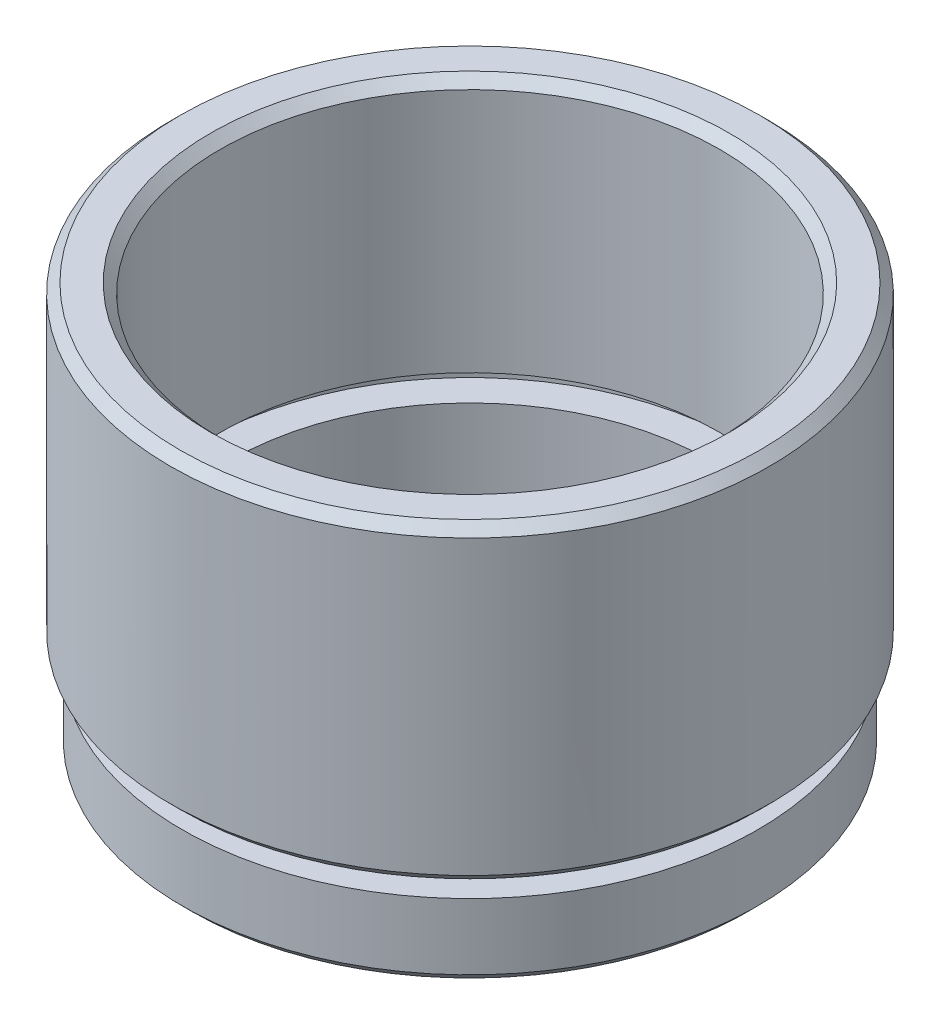
ISO-10303-21;
HEADER;
FILE_DESCRIPTION(('STEP AP214'),'2;1');
FILE_NAME('part.step','',(''),(''),'','','');
FILE_SCHEMA(('AUTOMOTIVE_DESIGN { 1 0 10303 214 1 1 1 1 }'));
ENDSEC;
DATA;
#1=APPLICATION_CONTEXT('core data for automotive mechanical design processes');
#2=APPLICATION_PROTOCOL_DEFINITION('international standard','automotive_design',2000,#1);
#3=PRODUCT_CONTEXT('',#1,'mechanical');
#4=PRODUCT('Part','Part','',(#3));
#5=PRODUCT_RELATED_PRODUCT_CATEGORY('part','',(#4));
#6=PRODUCT_DEFINITION_FORMATION('','',#4);
#7=PRODUCT_DEFINITION_CONTEXT('part definition',#1,'design');
#8=PRODUCT_DEFINITION('design','',#6,#7);
#9=PRODUCT_DEFINITION_SHAPE('','',#8);
#10=(LENGTH_UNIT() NAMED_UNIT(*) SI_UNIT(.MILLI.,.METRE.));
#11=(NAMED_UNIT(*) PLANE_ANGLE_UNIT() SI_UNIT($,.RADIAN.));
#12=(NAMED_UNIT(*) SI_UNIT($,.STERADIAN.) SOLID_ANGLE_UNIT());
#13=UNCERTAINTY_MEASURE_WITH_UNIT(LENGTH_MEASURE(1.E-05),#10,'distance_accuracy_value','');
#14=(GEOMETRIC_REPRESENTATION_CONTEXT(3) GLOBAL_UNCERTAINTY_ASSIGNED_CONTEXT((#13)) GLOBAL_UNIT_ASSIGNED_CONTEXT((#10,
#11,#12)) REPRESENTATION_CONTEXT('',''));
#15=CARTESIAN_POINT('',(0.,0.,0.));
#16=DIRECTION('',(0.,0.,1.));
#17=DIRECTION('',(1.,0.,0.));
#18=AXIS2_PLACEMENT_3D('',#15,#16,#17);
#19=CARTESIAN_POINT('',(0.,0.,0.));
#20=DIRECTION('',(0.,-1.,0.));
#21=DIRECTION('',(0.,0.,-1.));
#22=AXIS2_PLACEMENT_3D('',#19,#20,#21);
#23=CYLINDRICAL_SURFACE('',#22,12.);
#24=CARTESIAN_POINT('',(0.,0.,0.));
#25=DIRECTION('',(0.,-1.,0.));
#26=DIRECTION('',(0.,0.,-1.));
#27=AXIS2_PLACEMENT_3D('',#24,#25,#26);
#28=CIRCLE('',#27,12.);
#29=CARTESIAN_POINT('',(0.,0.,-12.));
#30=VERTEX_POINT('',#29);
#31=EDGE_CURVE('E66',#30,#30,#28,.T.);
#32=ORIENTED_EDGE('',*,*,#31,.T.);
#33=EDGE_LOOP('',(#32));
#34=FACE_BOUND('',#33,.T.);
#35=CARTESIAN_POINT('',(0.,2.,0.));
#36=DIRECTION('',(0.,-1.,0.));
#37=DIRECTION('',(0.,0.,-1.));
#38=AXIS2_PLACEMENT_3D('',#35,#36,#37);
#39=CIRCLE('',#38,12.);
#40=CARTESIAN_POINT('',(0.,2.,-12.));
#41=VERTEX_POINT('',#40);
#42=EDGE_CURVE('E93',#41,#41,#39,.T.);
#43=ORIENTED_EDGE('',*,*,#42,.F.);
#44=EDGE_LOOP('',(#43));
#45=FACE_BOUND('',#44,.T.);
#46=ADVANCED_FACE('F34',(#34,#45),#23,.F.);
#47=CARTESIAN_POINT('',(12.,0.,0.));
#48=DIRECTION('',(0.,-1.,0.));
#49=DIRECTION('',(0.,0.,-1.));
#50=AXIS2_PLACEMENT_3D('',#47,#48,#49);
#51=PLANE('',#50);
#52=CARTESIAN_POINT('',(0.,0.,0.));
#53=DIRECTION('',(0.,-1.,0.));
#54=DIRECTION('',(0.,0.,-1.));
#55=AXIS2_PLACEMENT_3D('',#52,#53,#54);
#56=CIRCLE('',#55,14.75);
#57=CARTESIAN_POINT('',(0.,0.,-14.75));
#58=VERTEX_POINT('',#57);
#59=EDGE_CURVE('E41',#58,#58,#56,.T.);
#60=ORIENTED_EDGE('',*,*,#59,.T.);
#61=EDGE_LOOP('',(#60));
#62=FACE_BOUND('',#61,.T.);
#63=ORIENTED_EDGE('',*,*,#31,.F.);
#64=EDGE_LOOP('',(#63));
#65=FACE_BOUND('',#64,.T.);
#66=ADVANCED_FACE('F101',(#62,#65),#51,.T.);
#67=CARTESIAN_POINT('',(0.,0.,0.));
#68=DIRECTION('',(0.,-1.,0.));
#69=DIRECTION('',(0.,0.,-1.));
#70=AXIS2_PLACEMENT_3D('',#67,#68,#69);
#71=CYLINDRICAL_SURFACE('',#70,15.25);
#72=CARTESIAN_POINT('',(0.,0.500000000000006,0.));
#73=DIRECTION('',(0.,-1.,0.));
#74=DIRECTION('',(0.,0.,-1.));
#75=AXIS2_PLACEMENT_3D('',#72,#73,#74);
#76=CIRCLE('',#75,15.25);
#77=CARTESIAN_POINT('',(0.,0.500000000000006,-15.25));
#78=VERTEX_POINT('',#77);
#79=EDGE_CURVE('E10',#78,#78,#76,.F.);
#80=ORIENTED_EDGE('',*,*,#79,.T.);
#81=EDGE_LOOP('',(#80));
#82=FACE_BOUND('',#81,.T.);
#83=CARTESIAN_POINT('',(0.,4.,0.));
#84=DIRECTION('',(0.,-1.,0.));
#85=DIRECTION('',(0.,0.,-1.));
#86=AXIS2_PLACEMENT_3D('',#83,#84,#85);
#87=CIRCLE('',#86,15.25);
#88=CARTESIAN_POINT('',(0.,4.,-15.25));
#89=VERTEX_POINT('',#88);
#90=EDGE_CURVE('E69',#89,#89,#87,.T.);
#91=ORIENTED_EDGE('',*,*,#90,.T.);
#92=EDGE_LOOP('',(#91));
#93=FACE_BOUND('',#92,.T.);
#94=ADVANCED_FACE('F107',(#82,#93),#71,.T.);
#95=CARTESIAN_POINT('',(15.25,4.,0.));
#96=DIRECTION('',(0.,1.,0.));
#97=DIRECTION('',(0.,0.,1.));
#98=AXIS2_PLACEMENT_3D('',#95,#96,#97);
#99=PLANE('',#98);
#100=CARTESIAN_POINT('',(0.,4.,0.));
#101=DIRECTION('',(0.,-1.,0.));
#102=DIRECTION('',(0.,0.,-1.));
#103=AXIS2_PLACEMENT_3D('',#100,#101,#102);
#104=CIRCLE('',#103,13.75);
#105=CARTESIAN_POINT('',(0.,4.,-13.75));
#106=VERTEX_POINT('',#105);
#107=EDGE_CURVE('E72',#106,#106,#104,.T.);
#108=ORIENTED_EDGE('',*,*,#107,.T.);
#109=EDGE_LOOP('',(#108));
#110=FACE_BOUND('',#109,.T.);
#111=ORIENTED_EDGE('',*,*,#90,.F.);
#112=EDGE_LOOP('',(#111));
#113=FACE_BOUND('',#112,.T.);
#114=ADVANCED_FACE('F139',(#110,#113),#99,.T.);
#115=CARTESIAN_POINT('',(0.,0.,0.));
#116=DIRECTION('',(0.,-1.,0.));
#117=DIRECTION('',(0.,0.,-1.));
#118=AXIS2_PLACEMENT_3D('',#115,#116,#117);
#119=CYLINDRICAL_SURFACE('',#118,13.75);
#120=CARTESIAN_POINT('',(0.,5.,0.));
#121=DIRECTION('',(0.,-1.,0.));
#122=DIRECTION('',(0.,0.,-1.));
#123=AXIS2_PLACEMENT_3D('',#120,#121,#122);
#124=CIRCLE('',#123,13.75);
#125=CARTESIAN_POINT('',(0.,5.,-13.75));
#126=VERTEX_POINT('',#125);
#127=EDGE_CURVE('E75',#126,#126,#124,.T.);
#128=ORIENTED_EDGE('',*,*,#127,.T.);
#129=EDGE_LOOP('',(#128));
#130=FACE_BOUND('',#129,.T.);
#131=ORIENTED_EDGE('',*,*,#107,.F.);
#132=EDGE_LOOP('',(#131));
#133=FACE_BOUND('',#132,.T.);
#134=ADVANCED_FACE('F133',(#130,#133),#119,.T.);
#135=CARTESIAN_POINT('',(13.75,5.,0.));
#136=DIRECTION('',(0.,-1.,0.));
#137=DIRECTION('',(0.,0.,-1.));
#138=AXIS2_PLACEMENT_3D('',#135,#136,#137);
#139=PLANE('',#138);
#140=CARTESIAN_POINT('',(0.,5.,0.));
#141=DIRECTION('',(0.,-1.,0.));
#142=DIRECTION('',(0.,0.,-1.));
#143=AXIS2_PLACEMENT_3D('',#140,#141,#142);
#144=CIRCLE('',#143,15.375);
#145=CARTESIAN_POINT('',(0.,5.,-15.375));
#146=VERTEX_POINT('',#145);
#147=EDGE_CURVE('E45',#146,#146,#144,.T.);
#148=ORIENTED_EDGE('',*,*,#147,.T.);
#149=EDGE_LOOP('',(#148));
#150=FACE_BOUND('',#149,.T.);
#151=ORIENTED_EDGE('',*,*,#127,.F.);
#152=EDGE_LOOP('',(#151));
#153=FACE_BOUND('',#152,.T.);
#154=ADVANCED_FACE('F129',(#150,#153),#139,.T.);
#155=CARTESIAN_POINT('',(0.,0.,0.));
#156=DIRECTION('',(0.,-1.,0.));
#157=DIRECTION('',(0.,0.,-1.));
#158=AXIS2_PLACEMENT_3D('',#155,#156,#157);
#159=CYLINDRICAL_SURFACE('',#158,15.875);
#160=CARTESIAN_POINT('',(0.,21.,0.));
#161=DIRECTION('',(0.,1.,0.));
#162=DIRECTION('',(0.,0.,1.));
#163=AXIS2_PLACEMENT_3D('',#160,#161,#162);
#164=CIRCLE('',#163,15.875);
#165=CARTESIAN_POINT('',(0.,21.,15.875));
#166=VERTEX_POINT('',#165);
#167=EDGE_CURVE('E49',#166,#166,#164,.F.);
#168=ORIENTED_EDGE('',*,*,#167,.T.);
#169=EDGE_LOOP('',(#168));
#170=FACE_BOUND('',#169,.T.);
#171=CARTESIAN_POINT('',(0.,5.50000000000001,0.));
#172=DIRECTION('',(0.,-1.,0.));
#173=DIRECTION('',(0.,0.,-1.));
#174=AXIS2_PLACEMENT_3D('',#171,#172,#173);
#175=CIRCLE('',#174,15.875);
#176=CARTESIAN_POINT('',(0.,5.50000000000001,-15.875));
#177=VERTEX_POINT('',#176);
#178=EDGE_CURVE('E54',#177,#177,#175,.F.);
#179=ORIENTED_EDGE('',*,*,#178,.T.);
#180=EDGE_LOOP('',(#179));
#181=FACE_BOUND('',#180,.T.);
#182=ADVANCED_FACE('F132',(#170,#181),#159,.T.);
#183=CARTESIAN_POINT('',(15.875,21.5,0.));
#184=DIRECTION('',(0.,1.,0.));
#185=DIRECTION('',(0.,0.,1.));
#186=AXIS2_PLACEMENT_3D('',#183,#184,#185);
#187=PLANE('',#186);
#188=CARTESIAN_POINT('',(0.,21.5,0.));
#189=DIRECTION('',(0.,1.,0.));
#190=DIRECTION('',(0.,0.,1.));
#191=AXIS2_PLACEMENT_3D('',#188,#189,#190);
#192=CIRCLE('',#191,13.75);
#193=CARTESIAN_POINT('',(0.,21.5,13.75));
#194=VERTEX_POINT('',#193);
#195=EDGE_CURVE('E60',#194,#194,#192,.F.);
#196=ORIENTED_EDGE('',*,*,#195,.T.);
#197=EDGE_LOOP('',(#196));
#198=FACE_BOUND('',#197,.T.);
#199=CARTESIAN_POINT('',(0.,21.5,0.));
#200=DIRECTION('',(0.,1.,0.));
#201=DIRECTION('',(0.,0.,1.));
#202=AXIS2_PLACEMENT_3D('',#199,#200,#201);
#203=CIRCLE('',#202,15.375);
#204=CARTESIAN_POINT('',(0.,21.5,15.375));
#205=VERTEX_POINT('',#204);
#206=EDGE_CURVE('E63',#205,#205,#203,.T.);
#207=ORIENTED_EDGE('',*,*,#206,.T.);
#208=EDGE_LOOP('',(#207));
#209=FACE_BOUND('',#208,.T.);
#210=ADVANCED_FACE('F154',(#198,#209),#187,.T.);
#211=CARTESIAN_POINT('',(0.,0.,0.));
#212=DIRECTION('',(0.,-1.,0.));
#213=DIRECTION('',(0.,0.,-1.));
#214=AXIS2_PLACEMENT_3D('',#211,#212,#213);
#215=CYLINDRICAL_SURFACE('',#214,13.25);
#216=CARTESIAN_POINT('',(0.,21.,0.));
#217=DIRECTION('',(0.,1.,0.));
#218=DIRECTION('',(0.,0.,1.));
#219=AXIS2_PLACEMENT_3D('',#216,#217,#218);
#220=CIRCLE('',#219,13.25);
#221=CARTESIAN_POINT('',(0.,21.,13.25));
#222=VERTEX_POINT('',#221);
#223=EDGE_CURVE('E57',#222,#222,#220,.T.);
#224=ORIENTED_EDGE('',*,*,#223,.T.);
#225=EDGE_LOOP('',(#224));
#226=FACE_BOUND('',#225,.T.);
#227=CARTESIAN_POINT('',(0.,8.,0.));
#228=DIRECTION('',(0.,-1.,0.));
#229=DIRECTION('',(0.,0.,-1.));
#230=AXIS2_PLACEMENT_3D('',#227,#228,#229);
#231=CIRCLE('',#230,13.25);
#232=CARTESIAN_POINT('',(0.,8.,-13.25));
#233=VERTEX_POINT('',#232);
#234=EDGE_CURVE('E78',#233,#233,#231,.T.);
#235=ORIENTED_EDGE('',*,*,#234,.T.);
#236=EDGE_LOOP('',(#235));
#237=FACE_BOUND('',#236,.T.);
#238=ADVANCED_FACE('F158',(#226,#237),#215,.F.);
#239=CARTESIAN_POINT('',(13.25,8.,0.));
#240=DIRECTION('',(0.,-1.,0.));
#241=DIRECTION('',(0.,0.,-1.));
#242=AXIS2_PLACEMENT_3D('',#239,#240,#241);
#243=PLANE('',#242);
#244=CARTESIAN_POINT('',(0.,8.,0.));
#245=DIRECTION('',(0.,-1.,0.));
#246=DIRECTION('',(0.,0.,-1.));
#247=AXIS2_PLACEMENT_3D('',#244,#245,#246);
#248=CIRCLE('',#247,14.35);
#249=CARTESIAN_POINT('',(0.,8.,-14.35));
#250=VERTEX_POINT('',#249);
#251=EDGE_CURVE('E81',#250,#250,#248,.T.);
#252=ORIENTED_EDGE('',*,*,#251,.T.);
#253=EDGE_LOOP('',(#252));
#254=FACE_BOUND('',#253,.T.);
#255=ORIENTED_EDGE('',*,*,#234,.F.);
#256=EDGE_LOOP('',(#255));
#257=FACE_BOUND('',#256,.T.);
#258=ADVANCED_FACE('F162',(#254,#257),#243,.T.);
#259=CARTESIAN_POINT('',(0.,0.,0.));
#260=DIRECTION('',(0.,-1.,0.));
#261=DIRECTION('',(0.,0.,-1.));
#262=AXIS2_PLACEMENT_3D('',#259,#260,#261);
#263=CYLINDRICAL_SURFACE('',#262,14.35);
#264=CARTESIAN_POINT('',(0.,7.,0.));
#265=DIRECTION('',(0.,-1.,0.));
#266=DIRECTION('',(0.,0.,-1.));
#267=AXIS2_PLACEMENT_3D('',#264,#265,#266);
#268=CIRCLE('',#267,14.35);
#269=CARTESIAN_POINT('',(0.,7.,-14.35));
#270=VERTEX_POINT('',#269);
#271=EDGE_CURVE('E84',#270,#270,#268,.T.);
#272=ORIENTED_EDGE('',*,*,#271,.T.);
#273=EDGE_LOOP('',(#272));
#274=FACE_BOUND('',#273,.T.);
#275=ORIENTED_EDGE('',*,*,#251,.F.);
#276=EDGE_LOOP('',(#275));
#277=FACE_BOUND('',#276,.T.);
#278=ADVANCED_FACE('F166',(#274,#277),#263,.F.);
#279=CARTESIAN_POINT('',(14.35,7.,0.));
#280=DIRECTION('',(0.,1.,0.));
#281=DIRECTION('',(0.,0.,1.));
#282=AXIS2_PLACEMENT_3D('',#279,#280,#281);
#283=PLANE('',#282);
#284=CARTESIAN_POINT('',(0.,7.,0.));
#285=DIRECTION('',(0.,-1.,0.));
#286=DIRECTION('',(0.,0.,-1.));
#287=AXIS2_PLACEMENT_3D('',#284,#285,#286);
#288=CIRCLE('',#287,12.7);
#289=CARTESIAN_POINT('',(0.,7.,-12.7));
#290=VERTEX_POINT('',#289);
#291=EDGE_CURVE('E87',#290,#290,#288,.T.);
#292=ORIENTED_EDGE('',*,*,#291,.T.);
#293=EDGE_LOOP('',(#292));
#294=FACE_BOUND('',#293,.T.);
#295=ORIENTED_EDGE('',*,*,#271,.F.);
#296=EDGE_LOOP('',(#295));
#297=FACE_BOUND('',#296,.T.);
#298=ADVANCED_FACE('F170',(#294,#297),#283,.T.);
#299=CARTESIAN_POINT('',(0.,0.,0.));
#300=DIRECTION('',(0.,-1.,0.));
#301=DIRECTION('',(0.,0.,-1.));
#302=AXIS2_PLACEMENT_3D('',#299,#300,#301);
#303=CYLINDRICAL_SURFACE('',#302,12.7);
#304=CARTESIAN_POINT('',(0.,2.,0.));
#305=DIRECTION('',(0.,-1.,0.));
#306=DIRECTION('',(0.,0.,-1.));
#307=AXIS2_PLACEMENT_3D('',#304,#305,#306);
#308=CIRCLE('',#307,12.7);
#309=CARTESIAN_POINT('',(0.,2.,-12.7));
#310=VERTEX_POINT('',#309);
#311=EDGE_CURVE('E90',#310,#310,#308,.T.);
#312=ORIENTED_EDGE('',*,*,#311,.T.);
#313=EDGE_LOOP('',(#312));
#314=FACE_BOUND('',#313,.T.);
#315=ORIENTED_EDGE('',*,*,#291,.F.);
#316=EDGE_LOOP('',(#315));
#317=FACE_BOUND('',#316,.T.);
#318=ADVANCED_FACE('F174',(#314,#317),#303,.F.);
#319=CARTESIAN_POINT('',(12.7,2.,0.));
#320=DIRECTION('',(0.,1.,0.));
#321=DIRECTION('',(0.,0.,1.));
#322=AXIS2_PLACEMENT_3D('',#319,#320,#321);
#323=PLANE('',#322);
#324=ORIENTED_EDGE('',*,*,#42,.T.);
#325=EDGE_LOOP('',(#324));
#326=FACE_BOUND('',#325,.T.);
#327=ORIENTED_EDGE('',*,*,#311,.F.);
#328=EDGE_LOOP('',(#327));
#329=FACE_BOUND('',#328,.T.);
#330=ADVANCED_FACE('F97',(#326,#329),#323,.T.);
#331=CARTESIAN_POINT('',(0.,21.5,0.));
#332=DIRECTION('',(0.,1.,0.));
#333=DIRECTION('',(0.,0.,1.));
#334=AXIS2_PLACEMENT_3D('',#331,#332,#333);
#335=CONICAL_SURFACE('',#334,13.75,0.785398163397448);
#336=ORIENTED_EDGE('',*,*,#223,.F.);
#337=EDGE_LOOP('',(#336));
#338=FACE_BOUND('',#337,.T.);
#339=ORIENTED_EDGE('',*,*,#195,.F.);
#340=EDGE_LOOP('',(#339));
#341=FACE_BOUND('',#340,.T.);
#342=ADVANCED_FACE('F111',(#338,#341),#335,.F.);
#343=CARTESIAN_POINT('',(0.,21.,0.));
#344=DIRECTION('',(0.,-1.,0.));
#345=DIRECTION('',(0.,0.,-1.));
#346=AXIS2_PLACEMENT_3D('',#343,#344,#345);
#347=CONICAL_SURFACE('',#346,15.875,0.785398163397455);
#348=ORIENTED_EDGE('',*,*,#206,.F.);
#349=EDGE_LOOP('',(#348));
#350=FACE_BOUND('',#349,.T.);
#351=ORIENTED_EDGE('',*,*,#167,.F.);
#352=EDGE_LOOP('',(#351));
#353=FACE_BOUND('',#352,.T.);
#354=ADVANCED_FACE('F114',(#350,#353),#347,.T.);
#355=CARTESIAN_POINT('',(0.,5.,0.));
#356=DIRECTION('',(0.,1.,0.));
#357=DIRECTION('',(0.,0.,1.));
#358=AXIS2_PLACEMENT_3D('',#355,#356,#357);
#359=CONICAL_SURFACE('',#358,15.375,0.785398163397445);
#360=ORIENTED_EDGE('',*,*,#178,.F.);
#361=EDGE_LOOP('',(#360));
#362=FACE_BOUND('',#361,.T.);
#363=ORIENTED_EDGE('',*,*,#147,.F.);
#364=EDGE_LOOP('',(#363));
#365=FACE_BOUND('',#364,.T.);
#366=ADVANCED_FACE('F117',(#362,#365),#359,.T.);
#367=CARTESIAN_POINT('',(0.,0.,0.));
#368=DIRECTION('',(0.,1.,0.));
#369=DIRECTION('',(0.,0.,1.));
#370=AXIS2_PLACEMENT_3D('',#367,#368,#369);
#371=CONICAL_SURFACE('',#370,14.75,0.78539816339745);
#372=ORIENTED_EDGE('',*,*,#79,.F.);
#373=EDGE_LOOP('',(#372));
#374=FACE_BOUND('',#373,.T.);
#375=ORIENTED_EDGE('',*,*,#59,.F.);
#376=EDGE_LOOP('',(#375));
#377=FACE_BOUND('',#376,.T.);
#378=ADVANCED_FACE('F36',(#374,#377),#371,.T.);
#379=CLOSED_SHELL('',(#46,#66,#94,#114,#134,#154,#182,#210,#238,#258,#278,#298,#318,#330,#342,
#354,#366,#378));
#380=MANIFOLD_SOLID_BREP('B2',#379);
#381=ADVANCED_BREP_SHAPE_REPRESENTATION('',(#18,#380),#14);
#382=SHAPE_DEFINITION_REPRESENTATION(#9,#381);
ENDSEC;
END-ISO-10303-21;
